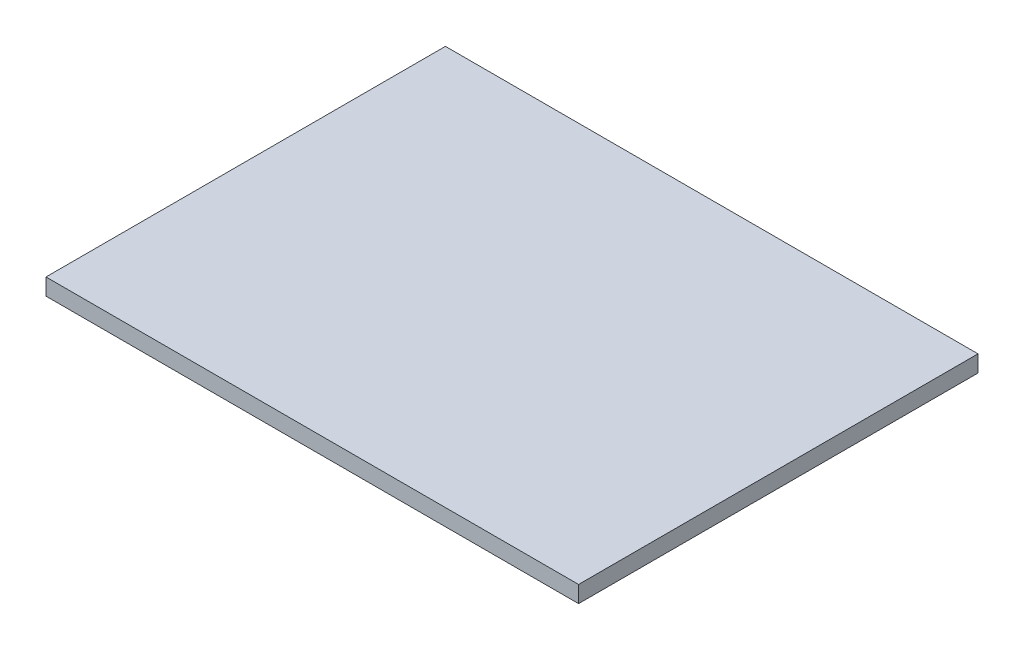
ISO-10303-21;
HEADER;
FILE_DESCRIPTION(('STEP AP214'),'2;1');
FILE_NAME('part.step','',(''),(''),'','','');
FILE_SCHEMA(('AUTOMOTIVE_DESIGN { 1 0 10303 214 1 1 1 1 }'));
ENDSEC;
DATA;
#1=APPLICATION_CONTEXT('core data for automotive mechanical design processes');
#2=APPLICATION_PROTOCOL_DEFINITION('international standard','automotive_design',2000,#1);
#3=PRODUCT_CONTEXT('',#1,'mechanical');
#4=PRODUCT('Part','Part','',(#3));
#5=PRODUCT_RELATED_PRODUCT_CATEGORY('part','',(#4));
#6=PRODUCT_DEFINITION_FORMATION('','',#4);
#7=PRODUCT_DEFINITION_CONTEXT('part definition',#1,'design');
#8=PRODUCT_DEFINITION('design','',#6,#7);
#9=PRODUCT_DEFINITION_SHAPE('','',#8);
#10=(LENGTH_UNIT() NAMED_UNIT(*) SI_UNIT(.MILLI.,.METRE.));
#11=(NAMED_UNIT(*) PLANE_ANGLE_UNIT() SI_UNIT($,.RADIAN.));
#12=(NAMED_UNIT(*) SI_UNIT($,.STERADIAN.) SOLID_ANGLE_UNIT());
#13=UNCERTAINTY_MEASURE_WITH_UNIT(LENGTH_MEASURE(1.E-05),#10,'distance_accuracy_value','');
#14=(GEOMETRIC_REPRESENTATION_CONTEXT(3) GLOBAL_UNCERTAINTY_ASSIGNED_CONTEXT((#13)) GLOBAL_UNIT_ASSIGNED_CONTEXT((#10,
#11,#12)) REPRESENTATION_CONTEXT('',''));
#15=CARTESIAN_POINT('',(0.,0.,0.));
#16=DIRECTION('',(0.,0.,1.));
#17=DIRECTION('',(1.,0.,0.));
#18=AXIS2_PLACEMENT_3D('',#15,#16,#17);
#19=CARTESIAN_POINT('',(40.,2.5,-30.));
#20=DIRECTION('',(-1.,0.,0.));
#21=DIRECTION('',(0.,0.,1.));
#22=AXIS2_PLACEMENT_3D('',#19,#20,#21);
#23=PLANE('',#22);
#24=DIRECTION('',(0.,0.,-1.));
#25=VECTOR('',#24,1.);
#26=CARTESIAN_POINT('',(40.,0.,-30.));
#27=LINE('',#26,#25);
#28=CARTESIAN_POINT('',(40.,0.,30.));
#29=VERTEX_POINT('',#28);
#30=CARTESIAN_POINT('',(40.,0.,-30.));
#31=VERTEX_POINT('',#30);
#32=EDGE_CURVE('E97',#29,#31,#27,.T.);
#33=ORIENTED_EDGE('',*,*,#32,.T.);
#34=DIRECTION('',(0.,-1.,0.));
#35=VECTOR('',#34,1.);
#36=CARTESIAN_POINT('',(40.,2.5,-30.));
#37=LINE('',#36,#35);
#38=CARTESIAN_POINT('',(40.,2.5,-30.));
#39=VERTEX_POINT('',#38);
#40=EDGE_CURVE('E11',#39,#31,#37,.T.);
#41=ORIENTED_EDGE('',*,*,#40,.F.);
#42=DIRECTION('',(0.,0.,-1.));
#43=VECTOR('',#42,1.);
#44=CARTESIAN_POINT('',(40.,2.5,-30.));
#45=LINE('',#44,#43);
#46=CARTESIAN_POINT('',(40.,2.5,30.));
#47=VERTEX_POINT('',#46);
#48=EDGE_CURVE('E85',#47,#39,#45,.T.);
#49=ORIENTED_EDGE('',*,*,#48,.F.);
#50=DIRECTION('',(0.,-1.,0.));
#51=VECTOR('',#50,1.);
#52=CARTESIAN_POINT('',(40.,2.5,30.));
#53=LINE('',#52,#51);
#54=EDGE_CURVE('E93',#47,#29,#53,.T.);
#55=ORIENTED_EDGE('',*,*,#54,.T.);
#56=EDGE_LOOP('',(#33,#41,#49,#55));
#57=FACE_BOUND('',#56,.T.);
#58=ADVANCED_FACE('F34',(#57),#23,.F.);
#59=CARTESIAN_POINT('',(-40.,2.5,-30.));
#60=DIRECTION('',(0.,0.,1.));
#61=DIRECTION('',(1.,0.,0.));
#62=AXIS2_PLACEMENT_3D('',#59,#60,#61);
#63=PLANE('',#62);
#64=DIRECTION('',(-1.,0.,0.));
#65=VECTOR('',#64,1.);
#66=CARTESIAN_POINT('',(-40.,0.,-30.));
#67=LINE('',#66,#65);
#68=CARTESIAN_POINT('',(-40.,0.,-30.));
#69=VERTEX_POINT('',#68);
#70=EDGE_CURVE('E89',#31,#69,#67,.T.);
#71=ORIENTED_EDGE('',*,*,#70,.T.);
#72=DIRECTION('',(0.,-1.,0.));
#73=VECTOR('',#72,1.);
#74=CARTESIAN_POINT('',(-40.,2.5,-30.));
#75=LINE('',#74,#73);
#76=CARTESIAN_POINT('',(-40.,2.5,-30.));
#77=VERTEX_POINT('',#76);
#78=EDGE_CURVE('E42',#77,#69,#75,.T.);
#79=ORIENTED_EDGE('',*,*,#78,.F.);
#80=DIRECTION('',(-1.,0.,0.));
#81=VECTOR('',#80,1.);
#82=CARTESIAN_POINT('',(-40.,2.5,-30.));
#83=LINE('',#82,#81);
#84=EDGE_CURVE('E80',#39,#77,#83,.T.);
#85=ORIENTED_EDGE('',*,*,#84,.F.);
#86=ORIENTED_EDGE('',*,*,#40,.T.);
#87=EDGE_LOOP('',(#71,#79,#85,#86));
#88=FACE_BOUND('',#87,.T.);
#89=ADVANCED_FACE('F88',(#88),#63,.F.);
#90=CARTESIAN_POINT('',(-40.,2.5,-30.));
#91=DIRECTION('',(1.,0.,0.));
#92=DIRECTION('',(0.,0.,-1.));
#93=AXIS2_PLACEMENT_3D('',#90,#91,#92);
#94=PLANE('',#93);
#95=DIRECTION('',(0.,0.,1.));
#96=VECTOR('',#95,1.);
#97=CARTESIAN_POINT('',(-40.,0.,-30.));
#98=LINE('',#97,#96);
#99=CARTESIAN_POINT('',(-40.,0.,30.));
#100=VERTEX_POINT('',#99);
#101=EDGE_CURVE('E67',#69,#100,#98,.T.);
#102=ORIENTED_EDGE('',*,*,#101,.T.);
#103=DIRECTION('',(0.,-1.,0.));
#104=VECTOR('',#103,1.);
#105=CARTESIAN_POINT('',(-40.,2.5,30.));
#106=LINE('',#105,#104);
#107=CARTESIAN_POINT('',(-40.,2.5,30.));
#108=VERTEX_POINT('',#107);
#109=EDGE_CURVE('E90',#108,#100,#106,.T.);
#110=ORIENTED_EDGE('',*,*,#109,.F.);
#111=DIRECTION('',(0.,0.,1.));
#112=VECTOR('',#111,1.);
#113=CARTESIAN_POINT('',(-40.,2.5,-30.));
#114=LINE('',#113,#112);
#115=EDGE_CURVE('E83',#77,#108,#114,.T.);
#116=ORIENTED_EDGE('',*,*,#115,.F.);
#117=ORIENTED_EDGE('',*,*,#78,.T.);
#118=EDGE_LOOP('',(#102,#110,#116,#117));
#119=FACE_BOUND('',#118,.T.);
#120=ADVANCED_FACE('F91',(#119),#94,.F.);
#121=CARTESIAN_POINT('',(-40.,2.5,30.));
#122=DIRECTION('',(0.,0.,-1.));
#123=DIRECTION('',(-1.,0.,0.));
#124=AXIS2_PLACEMENT_3D('',#121,#122,#123);
#125=PLANE('',#124);
#126=DIRECTION('',(1.,0.,0.));
#127=VECTOR('',#126,1.);
#128=CARTESIAN_POINT('',(-40.,0.,30.));
#129=LINE('',#128,#127);
#130=EDGE_CURVE('E73',#100,#29,#129,.T.);
#131=ORIENTED_EDGE('',*,*,#130,.T.);
#132=ORIENTED_EDGE('',*,*,#54,.F.);
#133=DIRECTION('',(1.,0.,0.));
#134=VECTOR('',#133,1.);
#135=CARTESIAN_POINT('',(-40.,2.5,30.));
#136=LINE('',#135,#134);
#137=EDGE_CURVE('E50',#108,#47,#136,.T.);
#138=ORIENTED_EDGE('',*,*,#137,.F.);
#139=ORIENTED_EDGE('',*,*,#109,.T.);
#140=EDGE_LOOP('',(#131,#132,#138,#139));
#141=FACE_BOUND('',#140,.T.);
#142=ADVANCED_FACE('F104',(#141),#125,.F.);
#143=CARTESIAN_POINT('',(0.,2.5,0.));
#144=DIRECTION('',(0.,1.,0.));
#145=DIRECTION('',(0.,0.,1.));
#146=AXIS2_PLACEMENT_3D('',#143,#144,#145);
#147=PLANE('',#146);
#148=ORIENTED_EDGE('',*,*,#48,.T.);
#149=ORIENTED_EDGE('',*,*,#84,.T.);
#150=ORIENTED_EDGE('',*,*,#115,.T.);
#151=ORIENTED_EDGE('',*,*,#137,.T.);
#152=EDGE_LOOP('',(#148,#149,#150,#151));
#153=FACE_BOUND('',#152,.T.);
#154=ADVANCED_FACE('F81',(#153),#147,.T.);
#155=CARTESIAN_POINT('',(0.,0.,0.));
#156=DIRECTION('',(0.,1.,0.));
#157=DIRECTION('',(0.,0.,1.));
#158=AXIS2_PLACEMENT_3D('',#155,#156,#157);
#159=PLANE('',#158);
#160=ORIENTED_EDGE('',*,*,#32,.F.);
#161=ORIENTED_EDGE('',*,*,#130,.F.);
#162=ORIENTED_EDGE('',*,*,#101,.F.);
#163=ORIENTED_EDGE('',*,*,#70,.F.);
#164=EDGE_LOOP('',(#160,#161,#162,#163));
#165=FACE_BOUND('',#164,.T.);
#166=ADVANCED_FACE('F107',(#165),#159,.F.);
#167=CLOSED_SHELL('',(#58,#89,#120,#142,#154,#166));
#168=MANIFOLD_SOLID_BREP('B2',#167);
#169=ADVANCED_BREP_SHAPE_REPRESENTATION('',(#18,#168),#14);
#170=SHAPE_DEFINITION_REPRESENTATION(#9,#169);
ENDSEC;
END-ISO-10303-21;
